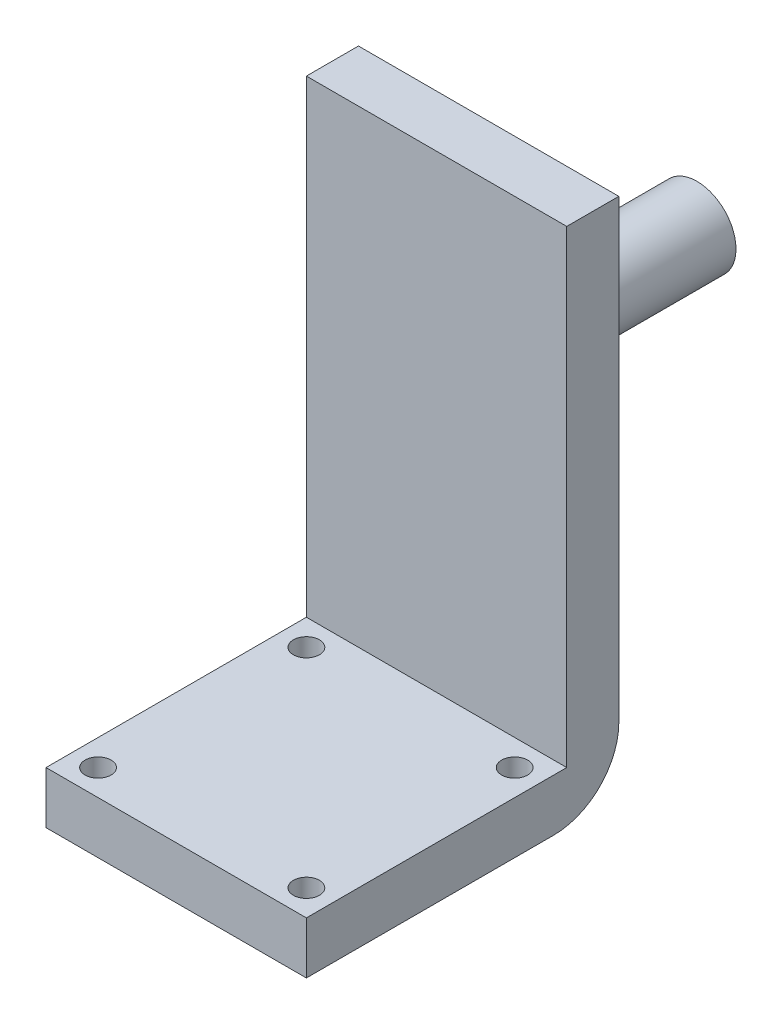
ISO-10303-21;
HEADER;
FILE_DESCRIPTION(('STEP AP214'),'2;1');
FILE_NAME('part.step','',(''),(''),'','','');
FILE_SCHEMA(('AUTOMOTIVE_DESIGN { 1 0 10303 214 1 1 1 1 }'));
ENDSEC;
DATA;
#1=APPLICATION_CONTEXT('core data for automotive mechanical design processes');
#2=APPLICATION_PROTOCOL_DEFINITION('international standard','automotive_design',2000,#1);
#3=PRODUCT_CONTEXT('',#1,'mechanical');
#4=PRODUCT('Part','Part','',(#3));
#5=PRODUCT_RELATED_PRODUCT_CATEGORY('part','',(#4));
#6=PRODUCT_DEFINITION_FORMATION('','',#4);
#7=PRODUCT_DEFINITION_CONTEXT('part definition',#1,'design');
#8=PRODUCT_DEFINITION('design','',#6,#7);
#9=PRODUCT_DEFINITION_SHAPE('','',#8);
#10=(LENGTH_UNIT() NAMED_UNIT(*) SI_UNIT(.MILLI.,.METRE.));
#11=(NAMED_UNIT(*) PLANE_ANGLE_UNIT() SI_UNIT($,.RADIAN.));
#12=(NAMED_UNIT(*) SI_UNIT($,.STERADIAN.) SOLID_ANGLE_UNIT());
#13=UNCERTAINTY_MEASURE_WITH_UNIT(LENGTH_MEASURE(1.E-05),#10,'distance_accuracy_value','');
#14=(GEOMETRIC_REPRESENTATION_CONTEXT(3) GLOBAL_UNCERTAINTY_ASSIGNED_CONTEXT((#13)) GLOBAL_UNIT_ASSIGNED_CONTEXT((#10,
#11,#12)) REPRESENTATION_CONTEXT('',''));
#15=CARTESIAN_POINT('',(0.,0.,0.));
#16=DIRECTION('',(0.,0.,1.));
#17=DIRECTION('',(1.,0.,0.));
#18=AXIS2_PLACEMENT_3D('',#15,#16,#17);
#19=CARTESIAN_POINT('',(0.,4.,0.));
#20=DIRECTION('',(0.,-1.,0.));
#21=DIRECTION('',(0.,0.,-1.));
#22=AXIS2_PLACEMENT_3D('',#19,#20,#21);
#23=PLANE('',#22);
#24=DIRECTION('',(0.,0.,-1.));
#25=VECTOR('',#24,1.);
#26=CARTESIAN_POINT('',(10.,4.,10.));
#27=LINE('',#26,#25);
#28=CARTESIAN_POINT('',(10.,4.,10.));
#29=VERTEX_POINT('',#28);
#30=CARTESIAN_POINT('',(10.,4.,-10.));
#31=VERTEX_POINT('',#30);
#32=EDGE_CURVE('E179',#29,#31,#27,.T.);
#33=ORIENTED_EDGE('',*,*,#32,.T.);
#34=DIRECTION('',(-1.,0.,0.));
#35=VECTOR('',#34,1.);
#36=CARTESIAN_POINT('',(-10.,4.,-10.));
#37=LINE('',#36,#35);
#38=CARTESIAN_POINT('',(-10.,4.,-10.));
#39=VERTEX_POINT('',#38);
#40=EDGE_CURVE('E183',#31,#39,#37,.T.);
#41=ORIENTED_EDGE('',*,*,#40,.T.);
#42=DIRECTION('',(0.,0.,1.));
#43=VECTOR('',#42,1.);
#44=CARTESIAN_POINT('',(-10.,4.,10.));
#45=LINE('',#44,#43);
#46=CARTESIAN_POINT('',(-10.,4.,10.));
#47=VERTEX_POINT('',#46);
#48=EDGE_CURVE('E188',#39,#47,#45,.T.);
#49=ORIENTED_EDGE('',*,*,#48,.T.);
#50=DIRECTION('',(1.,0.,0.));
#51=VECTOR('',#50,1.);
#52=CARTESIAN_POINT('',(-10.,4.,10.));
#53=LINE('',#52,#51);
#54=EDGE_CURVE('E191',#47,#29,#53,.T.);
#55=ORIENTED_EDGE('',*,*,#54,.T.);
#56=EDGE_LOOP('',(#33,#41,#49,#55));
#57=FACE_BOUND('',#56,.T.);
#58=CARTESIAN_POINT('',(-8.,4.,-8.));
#59=DIRECTION('',(0.,1.,0.));
#60=DIRECTION('',(0.,0.,1.));
#61=AXIS2_PLACEMENT_3D('',#58,#59,#60);
#62=CIRCLE('',#61,1.);
#63=CARTESIAN_POINT('',(-8.,4.,-7.));
#64=VERTEX_POINT('',#63);
#65=EDGE_CURVE('E172',#64,#64,#62,.T.);
#66=ORIENTED_EDGE('',*,*,#65,.F.);
#67=EDGE_LOOP('',(#66));
#68=FACE_BOUND('',#67,.T.);
#69=CARTESIAN_POINT('',(-8.,4.,8.));
#70=DIRECTION('',(0.,1.,0.));
#71=DIRECTION('',(0.,0.,1.));
#72=AXIS2_PLACEMENT_3D('',#69,#70,#71);
#73=CIRCLE('',#72,1.);
#74=CARTESIAN_POINT('',(-8.,4.,9.));
#75=VERTEX_POINT('',#74);
#76=EDGE_CURVE('E164',#75,#75,#73,.T.);
#77=ORIENTED_EDGE('',*,*,#76,.F.);
#78=EDGE_LOOP('',(#77));
#79=FACE_BOUND('',#78,.T.);
#80=CARTESIAN_POINT('',(8.,4.,8.));
#81=DIRECTION('',(0.,1.,0.));
#82=DIRECTION('',(0.,0.,1.));
#83=AXIS2_PLACEMENT_3D('',#80,#81,#82);
#84=CIRCLE('',#83,1.);
#85=CARTESIAN_POINT('',(8.,4.,9.));
#86=VERTEX_POINT('',#85);
#87=EDGE_CURVE('E156',#86,#86,#84,.T.);
#88=ORIENTED_EDGE('',*,*,#87,.F.);
#89=EDGE_LOOP('',(#88));
#90=FACE_BOUND('',#89,.T.);
#91=CARTESIAN_POINT('',(8.,4.,-8.));
#92=DIRECTION('',(0.,1.,0.));
#93=DIRECTION('',(0.,0.,1.));
#94=AXIS2_PLACEMENT_3D('',#91,#92,#93);
#95=CIRCLE('',#94,0.999999999999999);
#96=CARTESIAN_POINT('',(8.,4.,-7.));
#97=VERTEX_POINT('',#96);
#98=EDGE_CURVE('E149',#97,#97,#95,.T.);
#99=ORIENTED_EDGE('',*,*,#98,.F.);
#100=EDGE_LOOP('',(#99));
#101=FACE_BOUND('',#100,.T.);
#102=ADVANCED_FACE('F39',(#57,#68,#79,#90,#101),#23,.F.);
#103=CARTESIAN_POINT('',(0.,0.,0.));
#104=DIRECTION('',(0.,-1.,0.));
#105=DIRECTION('',(0.,0.,-1.));
#106=AXIS2_PLACEMENT_3D('',#103,#104,#105);
#107=PLANE('',#106);
#108=CARTESIAN_POINT('',(8.,0.,8.));
#109=DIRECTION('',(0.,1.,0.));
#110=DIRECTION('',(0.,0.,1.));
#111=AXIS2_PLACEMENT_3D('',#108,#109,#110);
#112=CIRCLE('',#111,1.);
#113=CARTESIAN_POINT('',(8.,0.,9.));
#114=VERTEX_POINT('',#113);
#115=EDGE_CURVE('E153',#114,#114,#112,.T.);
#116=ORIENTED_EDGE('',*,*,#115,.T.);
#117=EDGE_LOOP('',(#116));
#118=FACE_BOUND('',#117,.T.);
#119=DIRECTION('',(0.,0.,1.));
#120=VECTOR('',#119,1.);
#121=CARTESIAN_POINT('',(-10.,0.,10.));
#122=LINE('',#121,#120);
#123=CARTESIAN_POINT('',(-10.,0.,-9.));
#124=VERTEX_POINT('',#123);
#125=CARTESIAN_POINT('',(-10.,0.,10.));
#126=VERTEX_POINT('',#125);
#127=EDGE_CURVE('E197',#124,#126,#122,.T.);
#128=ORIENTED_EDGE('',*,*,#127,.F.);
#129=DIRECTION('',(-1.,0.,0.));
#130=VECTOR('',#129,1.);
#131=CARTESIAN_POINT('',(10.,0.,-9.));
#132=LINE('',#131,#130);
#133=CARTESIAN_POINT('',(-8.,0.,-9.));
#134=VERTEX_POINT('',#133);
#135=EDGE_CURVE('E48',#124,#134,#132,.F.);
#136=ORIENTED_EDGE('',*,*,#135,.T.);
#137=CARTESIAN_POINT('',(-8.,0.,-8.));
#138=DIRECTION('',(0.,1.,0.));
#139=DIRECTION('',(0.,0.,1.));
#140=AXIS2_PLACEMENT_3D('',#137,#138,#139);
#141=CIRCLE('',#140,1.);
#142=EDGE_CURVE('E168',#134,#134,#141,.T.);
#143=ORIENTED_EDGE('',*,*,#142,.T.);
#144=DIRECTION('',(-1.,0.,0.));
#145=VECTOR('',#144,1.);
#146=CARTESIAN_POINT('',(10.,0.,-9.));
#147=LINE('',#146,#145);
#148=CARTESIAN_POINT('',(8.,0.,-9.));
#149=VERTEX_POINT('',#148);
#150=EDGE_CURVE('E55',#134,#149,#147,.F.);
#151=ORIENTED_EDGE('',*,*,#150,.T.);
#152=CARTESIAN_POINT('',(8.,0.,-8.));
#153=DIRECTION('',(0.,1.,0.));
#154=DIRECTION('',(0.,0.,1.));
#155=AXIS2_PLACEMENT_3D('',#152,#153,#154);
#156=CIRCLE('',#155,0.999999999999999);
#157=EDGE_CURVE('E127',#149,#149,#156,.T.);
#158=ORIENTED_EDGE('',*,*,#157,.T.);
#159=DIRECTION('',(-1.,0.,0.));
#160=VECTOR('',#159,1.);
#161=CARTESIAN_POINT('',(10.,0.,-9.));
#162=LINE('',#161,#160);
#163=CARTESIAN_POINT('',(10.,0.,-9.));
#164=VERTEX_POINT('',#163);
#165=EDGE_CURVE('E60',#149,#164,#162,.F.);
#166=ORIENTED_EDGE('',*,*,#165,.T.);
#167=DIRECTION('',(0.,0.,-1.));
#168=VECTOR('',#167,1.);
#169=CARTESIAN_POINT('',(10.,0.,10.));
#170=LINE('',#169,#168);
#171=CARTESIAN_POINT('',(10.,0.,10.));
#172=VERTEX_POINT('',#171);
#173=EDGE_CURVE('E176',#172,#164,#170,.T.);
#174=ORIENTED_EDGE('',*,*,#173,.F.);
#175=DIRECTION('',(1.,0.,0.));
#176=VECTOR('',#175,1.);
#177=CARTESIAN_POINT('',(-10.,0.,10.));
#178=LINE('',#177,#176);
#179=EDGE_CURVE('E184',#126,#172,#178,.T.);
#180=ORIENTED_EDGE('',*,*,#179,.F.);
#181=EDGE_LOOP('',(#128,#136,#143,#151,#158,#166,#174,#180));
#182=FACE_BOUND('',#181,.T.);
#183=CARTESIAN_POINT('',(-8.,0.,8.));
#184=DIRECTION('',(0.,1.,0.));
#185=DIRECTION('',(0.,0.,1.));
#186=AXIS2_PLACEMENT_3D('',#183,#184,#185);
#187=CIRCLE('',#186,1.);
#188=CARTESIAN_POINT('',(-8.,0.,9.));
#189=VERTEX_POINT('',#188);
#190=EDGE_CURVE('E160',#189,#189,#187,.T.);
#191=ORIENTED_EDGE('',*,*,#190,.T.);
#192=EDGE_LOOP('',(#191));
#193=FACE_BOUND('',#192,.T.);
#194=ADVANCED_FACE('F220',(#118,#182,#193),#107,.T.);
#195=CARTESIAN_POINT('',(10.,4.,10.));
#196=DIRECTION('',(-1.,0.,0.));
#197=DIRECTION('',(0.,0.,1.));
#198=AXIS2_PLACEMENT_3D('',#195,#196,#197);
#199=PLANE('',#198);
#200=ORIENTED_EDGE('',*,*,#173,.T.);
#201=CARTESIAN_POINT('',(10.,5.,-9.));
#202=DIRECTION('',(-1.,0.,0.));
#203=DIRECTION('',(0.,0.,1.));
#204=AXIS2_PLACEMENT_3D('',#201,#202,#203);
#205=CIRCLE('',#204,5.);
#206=CARTESIAN_POINT('',(10.,5.,-14.));
#207=VERTEX_POINT('',#206);
#208=EDGE_CURVE('E11',#164,#207,#205,.F.);
#209=ORIENTED_EDGE('',*,*,#208,.T.);
#210=DIRECTION('',(0.,-1.,0.));
#211=VECTOR('',#210,1.);
#212=CARTESIAN_POINT('',(10.,0.,-14.));
#213=LINE('',#212,#211);
#214=CARTESIAN_POINT('',(10.,40.,-14.));
#215=VERTEX_POINT('',#214);
#216=EDGE_CURVE('E117',#215,#207,#213,.T.);
#217=ORIENTED_EDGE('',*,*,#216,.F.);
#218=DIRECTION('',(0.,0.,1.));
#219=VECTOR('',#218,1.);
#220=CARTESIAN_POINT('',(10.,40.,-14.));
#221=LINE('',#220,#219);
#222=CARTESIAN_POINT('',(10.,40.,-10.));
#223=VERTEX_POINT('',#222);
#224=EDGE_CURVE('E128',#215,#223,#221,.T.);
#225=ORIENTED_EDGE('',*,*,#224,.T.);
#226=DIRECTION('',(0.,-1.,0.));
#227=VECTOR('',#226,1.);
#228=CARTESIAN_POINT('',(10.,0.,-10.));
#229=LINE('',#228,#227);
#230=EDGE_CURVE('E139',#223,#31,#229,.T.);
#231=ORIENTED_EDGE('',*,*,#230,.T.);
#232=ORIENTED_EDGE('',*,*,#32,.F.);
#233=DIRECTION('',(0.,-1.,0.));
#234=VECTOR('',#233,1.);
#235=CARTESIAN_POINT('',(10.,4.,10.));
#236=LINE('',#235,#234);
#237=EDGE_CURVE('E194',#29,#172,#236,.T.);
#238=ORIENTED_EDGE('',*,*,#237,.T.);
#239=EDGE_LOOP('',(#200,#209,#217,#225,#231,#232,#238));
#240=FACE_BOUND('',#239,.T.);
#241=ADVANCED_FACE('F227',(#240),#199,.F.);
#242=CARTESIAN_POINT('',(-10.,4.,10.));
#243=DIRECTION('',(1.,0.,0.));
#244=DIRECTION('',(0.,0.,-1.));
#245=AXIS2_PLACEMENT_3D('',#242,#243,#244);
#246=PLANE('',#245);
#247=DIRECTION('',(0.,1.,0.));
#248=VECTOR('',#247,1.);
#249=CARTESIAN_POINT('',(-10.,0.,-14.));
#250=LINE('',#249,#248);
#251=CARTESIAN_POINT('',(-10.,5.,-14.));
#252=VERTEX_POINT('',#251);
#253=CARTESIAN_POINT('',(-10.,40.,-14.));
#254=VERTEX_POINT('',#253);
#255=EDGE_CURVE('E105',#252,#254,#250,.T.);
#256=ORIENTED_EDGE('',*,*,#255,.F.);
#257=CARTESIAN_POINT('',(-10.,5.,-9.));
#258=DIRECTION('',(1.,0.,0.));
#259=DIRECTION('',(0.,0.,-1.));
#260=AXIS2_PLACEMENT_3D('',#257,#258,#259);
#261=CIRCLE('',#260,5.);
#262=EDGE_CURVE('E211',#252,#124,#261,.F.);
#263=ORIENTED_EDGE('',*,*,#262,.T.);
#264=ORIENTED_EDGE('',*,*,#127,.T.);
#265=DIRECTION('',(0.,-1.,0.));
#266=VECTOR('',#265,1.);
#267=CARTESIAN_POINT('',(-10.,4.,10.));
#268=LINE('',#267,#266);
#269=EDGE_CURVE('E205',#47,#126,#268,.T.);
#270=ORIENTED_EDGE('',*,*,#269,.F.);
#271=ORIENTED_EDGE('',*,*,#48,.F.);
#272=DIRECTION('',(0.,1.,0.));
#273=VECTOR('',#272,1.);
#274=CARTESIAN_POINT('',(-10.,0.,-10.));
#275=LINE('',#274,#273);
#276=CARTESIAN_POINT('',(-10.,40.,-10.));
#277=VERTEX_POINT('',#276);
#278=EDGE_CURVE('E123',#39,#277,#275,.T.);
#279=ORIENTED_EDGE('',*,*,#278,.T.);
#280=DIRECTION('',(0.,0.,1.));
#281=VECTOR('',#280,1.);
#282=CARTESIAN_POINT('',(-10.,40.,-14.));
#283=LINE('',#282,#281);
#284=EDGE_CURVE('E120',#254,#277,#283,.T.);
#285=ORIENTED_EDGE('',*,*,#284,.F.);
#286=EDGE_LOOP('',(#256,#263,#264,#270,#271,#279,#285));
#287=FACE_BOUND('',#286,.T.);
#288=ADVANCED_FACE('F121',(#287),#246,.F.);
#289=CARTESIAN_POINT('',(-10.,4.,10.));
#290=DIRECTION('',(0.,0.,-1.));
#291=DIRECTION('',(-1.,0.,0.));
#292=AXIS2_PLACEMENT_3D('',#289,#290,#291);
#293=PLANE('',#292);
#294=ORIENTED_EDGE('',*,*,#179,.T.);
#295=ORIENTED_EDGE('',*,*,#237,.F.);
#296=ORIENTED_EDGE('',*,*,#54,.F.);
#297=ORIENTED_EDGE('',*,*,#269,.T.);
#298=EDGE_LOOP('',(#294,#295,#296,#297));
#299=FACE_BOUND('',#298,.T.);
#300=ADVANCED_FACE('F261',(#299),#293,.F.);
#301=CARTESIAN_POINT('',(-8.,4.,-8.));
#302=DIRECTION('',(0.,-1.,0.));
#303=DIRECTION('',(0.,0.,-1.));
#304=AXIS2_PLACEMENT_3D('',#301,#302,#303);
#305=CYLINDRICAL_SURFACE('',#304,1.);
#306=ORIENTED_EDGE('',*,*,#65,.T.);
#307=EDGE_LOOP('',(#306));
#308=FACE_BOUND('',#307,.T.);
#309=ORIENTED_EDGE('',*,*,#142,.F.);
#310=EDGE_LOOP('',(#309));
#311=FACE_BOUND('',#310,.T.);
#312=ADVANCED_FACE('F258',(#308,#311),#305,.F.);
#313=CARTESIAN_POINT('',(-8.,4.,8.));
#314=DIRECTION('',(0.,-1.,0.));
#315=DIRECTION('',(0.,0.,-1.));
#316=AXIS2_PLACEMENT_3D('',#313,#314,#315);
#317=CYLINDRICAL_SURFACE('',#316,1.);
#318=ORIENTED_EDGE('',*,*,#76,.T.);
#319=EDGE_LOOP('',(#318));
#320=FACE_BOUND('',#319,.T.);
#321=ORIENTED_EDGE('',*,*,#190,.F.);
#322=EDGE_LOOP('',(#321));
#323=FACE_BOUND('',#322,.T.);
#324=ADVANCED_FACE('F286',(#320,#323),#317,.F.);
#325=CARTESIAN_POINT('',(8.,4.,8.));
#326=DIRECTION('',(0.,-1.,0.));
#327=DIRECTION('',(0.,0.,-1.));
#328=AXIS2_PLACEMENT_3D('',#325,#326,#327);
#329=CYLINDRICAL_SURFACE('',#328,1.);
#330=ORIENTED_EDGE('',*,*,#87,.T.);
#331=EDGE_LOOP('',(#330));
#332=FACE_BOUND('',#331,.T.);
#333=ORIENTED_EDGE('',*,*,#115,.F.);
#334=EDGE_LOOP('',(#333));
#335=FACE_BOUND('',#334,.T.);
#336=ADVANCED_FACE('F293',(#332,#335),#329,.F.);
#337=CARTESIAN_POINT('',(8.,4.,-8.));
#338=DIRECTION('',(0.,-1.,0.));
#339=DIRECTION('',(0.,0.,-1.));
#340=AXIS2_PLACEMENT_3D('',#337,#338,#339);
#341=CYLINDRICAL_SURFACE('',#340,0.999999999999999);
#342=ORIENTED_EDGE('',*,*,#98,.T.);
#343=EDGE_LOOP('',(#342));
#344=FACE_BOUND('',#343,.T.);
#345=ORIENTED_EDGE('',*,*,#157,.F.);
#346=EDGE_LOOP('',(#345));
#347=FACE_BOUND('',#346,.T.);
#348=ADVANCED_FACE('F300',(#344,#347),#341,.F.);
#349=CARTESIAN_POINT('',(0.,0.,-10.));
#350=DIRECTION('',(0.,0.,1.));
#351=DIRECTION('',(1.,0.,0.));
#352=AXIS2_PLACEMENT_3D('',#349,#350,#351);
#353=PLANE('',#352);
#354=ORIENTED_EDGE('',*,*,#40,.F.);
#355=ORIENTED_EDGE('',*,*,#230,.F.);
#356=DIRECTION('',(1.,0.,0.));
#357=VECTOR('',#356,1.);
#358=CARTESIAN_POINT('',(10.,40.,-10.));
#359=LINE('',#358,#357);
#360=EDGE_CURVE('E146',#277,#223,#359,.T.);
#361=ORIENTED_EDGE('',*,*,#360,.F.);
#362=ORIENTED_EDGE('',*,*,#278,.F.);
#363=EDGE_LOOP('',(#354,#355,#361,#362));
#364=FACE_BOUND('',#363,.T.);
#365=ADVANCED_FACE('F307',(#364),#353,.T.);
#366=CARTESIAN_POINT('',(0.,0.,-14.));
#367=DIRECTION('',(0.,0.,1.));
#368=DIRECTION('',(1.,0.,0.));
#369=AXIS2_PLACEMENT_3D('',#366,#367,#368);
#370=PLANE('',#369);
#371=ORIENTED_EDGE('',*,*,#216,.T.);
#372=DIRECTION('',(-1.,0.,0.));
#373=VECTOR('',#372,1.);
#374=CARTESIAN_POINT('',(-10.,5.,-14.));
#375=LINE('',#374,#373);
#376=EDGE_CURVE('E114',#207,#252,#375,.T.);
#377=ORIENTED_EDGE('',*,*,#376,.T.);
#378=ORIENTED_EDGE('',*,*,#255,.T.);
#379=DIRECTION('',(1.,0.,0.));
#380=VECTOR('',#379,1.);
#381=CARTESIAN_POINT('',(10.,40.,-14.));
#382=LINE('',#381,#380);
#383=EDGE_CURVE('E111',#254,#215,#382,.T.);
#384=ORIENTED_EDGE('',*,*,#383,.T.);
#385=EDGE_LOOP('',(#371,#377,#378,#384));
#386=FACE_BOUND('',#385,.T.);
#387=CARTESIAN_POINT('',(0.,25.,-14.));
#388=DIRECTION('',(0.,0.,-1.));
#389=DIRECTION('',(-1.,0.,0.));
#390=AXIS2_PLACEMENT_3D('',#387,#388,#389);
#391=CIRCLE('',#390,3.);
#392=CARTESIAN_POINT('',(-3.,25.,-14.));
#393=VERTEX_POINT('',#392);
#394=EDGE_CURVE('E143',#393,#393,#391,.T.);
#395=ORIENTED_EDGE('',*,*,#394,.F.);
#396=EDGE_LOOP('',(#395));
#397=FACE_BOUND('',#396,.T.);
#398=ADVANCED_FACE('F108',(#386,#397),#370,.F.);
#399=CARTESIAN_POINT('',(10.,40.,-14.));
#400=DIRECTION('',(0.,-1.,0.));
#401=DIRECTION('',(0.,0.,-1.));
#402=AXIS2_PLACEMENT_3D('',#399,#400,#401);
#403=PLANE('',#402);
#404=ORIENTED_EDGE('',*,*,#360,.T.);
#405=ORIENTED_EDGE('',*,*,#224,.F.);
#406=ORIENTED_EDGE('',*,*,#383,.F.);
#407=ORIENTED_EDGE('',*,*,#284,.T.);
#408=EDGE_LOOP('',(#404,#405,#406,#407));
#409=FACE_BOUND('',#408,.T.);
#410=ADVANCED_FACE('F130',(#409),#403,.F.);
#411=CARTESIAN_POINT('',(0.,5.,-9.));
#412=DIRECTION('',(1.,0.,0.));
#413=DIRECTION('',(0.,0.,-1.));
#414=AXIS2_PLACEMENT_3D('',#411,#412,#413);
#415=CYLINDRICAL_SURFACE('',#414,5.);
#416=ORIENTED_EDGE('',*,*,#150,.F.);
#417=ORIENTED_EDGE('',*,*,#135,.F.);
#418=ORIENTED_EDGE('',*,*,#262,.F.);
#419=ORIENTED_EDGE('',*,*,#376,.F.);
#420=ORIENTED_EDGE('',*,*,#208,.F.);
#421=ORIENTED_EDGE('',*,*,#165,.F.);
#422=EDGE_LOOP('',(#416,#417,#418,#419,#420,#421));
#423=FACE_BOUND('',#422,.T.);
#424=ADVANCED_FACE('F41',(#423),#415,.T.);
#425=CARTESIAN_POINT('',(0.,25.,-30.));
#426=DIRECTION('',(0.,0.,1.));
#427=DIRECTION('',(1.,0.,0.));
#428=AXIS2_PLACEMENT_3D('',#425,#426,#427);
#429=CYLINDRICAL_SURFACE('',#428,3.);
#430=CARTESIAN_POINT('',(0.,25.,-30.));
#431=DIRECTION('',(0.,0.,1.));
#432=DIRECTION('',(1.,0.,0.));
#433=AXIS2_PLACEMENT_3D('',#430,#431,#432);
#434=CIRCLE('',#433,3.);
#435=CARTESIAN_POINT('',(3.,25.,-30.));
#436=VERTEX_POINT('',#435);
#437=EDGE_CURVE('E233',#436,#436,#434,.T.);
#438=ORIENTED_EDGE('',*,*,#437,.T.);
#439=EDGE_LOOP('',(#438));
#440=FACE_BOUND('',#439,.T.);
#441=ORIENTED_EDGE('',*,*,#394,.T.);
#442=EDGE_LOOP('',(#441));
#443=FACE_BOUND('',#442,.T.);
#444=ADVANCED_FACE('F238',(#440,#443),#429,.T.);
#445=CARTESIAN_POINT('',(0.,25.,-30.));
#446=DIRECTION('',(0.,0.,1.));
#447=DIRECTION('',(1.,0.,0.));
#448=AXIS2_PLACEMENT_3D('',#445,#446,#447);
#449=PLANE('',#448);
#450=ORIENTED_EDGE('',*,*,#437,.F.);
#451=EDGE_LOOP('',(#450));
#452=FACE_BOUND('',#451,.T.);
#453=ADVANCED_FACE('F241',(#452),#449,.F.);
#454=CLOSED_SHELL('',(#102,#194,#241,#288,#300,#312,#324,#336,#348,#365,#398,#410,#424,#444,#453));
#455=MANIFOLD_SOLID_BREP('B2',#454);
#456=ADVANCED_BREP_SHAPE_REPRESENTATION('',(#18,#455),#14);
#457=SHAPE_DEFINITION_REPRESENTATION(#9,#456);
ENDSEC;
END-ISO-10303-21;
